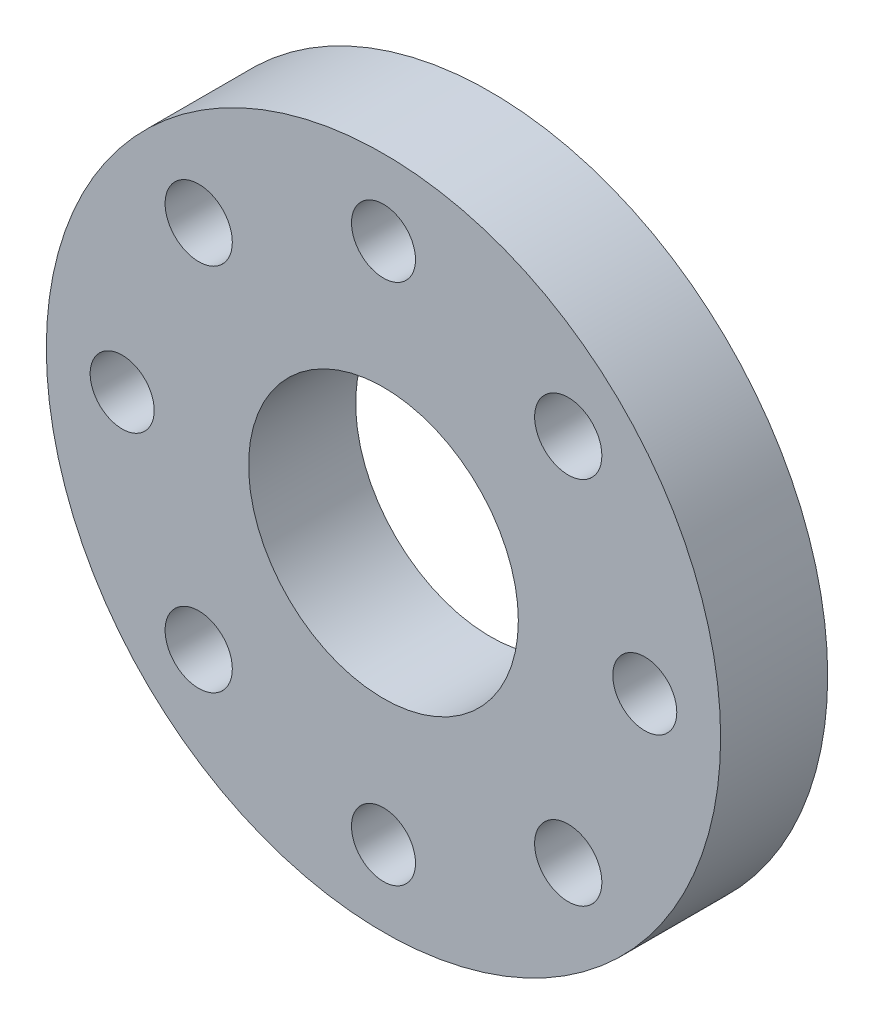
ISO-10303-21;
HEADER;
FILE_DESCRIPTION(('STEP AP214'),'2;1');
FILE_NAME('part.step','',(''),(''),'','','');
FILE_SCHEMA(('AUTOMOTIVE_DESIGN { 1 0 10303 214 1 1 1 1 }'));
ENDSEC;
DATA;
#1=APPLICATION_CONTEXT('core data for automotive mechanical design processes');
#2=APPLICATION_PROTOCOL_DEFINITION('international standard','automotive_design',2000,#1);
#3=PRODUCT_CONTEXT('',#1,'mechanical');
#4=PRODUCT('Part','Part','',(#3));
#5=PRODUCT_RELATED_PRODUCT_CATEGORY('part','',(#4));
#6=PRODUCT_DEFINITION_FORMATION('','',#4);
#7=PRODUCT_DEFINITION_CONTEXT('part definition',#1,'design');
#8=PRODUCT_DEFINITION('design','',#6,#7);
#9=PRODUCT_DEFINITION_SHAPE('','',#8);
#10=(LENGTH_UNIT() NAMED_UNIT(*) SI_UNIT(.MILLI.,.METRE.));
#11=(NAMED_UNIT(*) PLANE_ANGLE_UNIT() SI_UNIT($,.RADIAN.));
#12=(NAMED_UNIT(*) SI_UNIT($,.STERADIAN.) SOLID_ANGLE_UNIT());
#13=UNCERTAINTY_MEASURE_WITH_UNIT(LENGTH_MEASURE(1.E-05),#10,'distance_accuracy_value','');
#14=(GEOMETRIC_REPRESENTATION_CONTEXT(3) GLOBAL_UNCERTAINTY_ASSIGNED_CONTEXT((#13)) GLOBAL_UNIT_ASSIGNED_CONTEXT((#10,
#11,#12)) REPRESENTATION_CONTEXT('',''));
#15=CARTESIAN_POINT('',(0.,0.,0.));
#16=DIRECTION('',(0.,0.,1.));
#17=DIRECTION('',(1.,0.,0.));
#18=AXIS2_PLACEMENT_3D('',#15,#16,#17);
#19=CARTESIAN_POINT('',(0.,0.,6.35));
#20=DIRECTION('',(0.,0.,1.));
#21=DIRECTION('',(1.,0.,0.));
#22=AXIS2_PLACEMENT_3D('',#19,#20,#21);
#23=PLANE('',#22);
#24=CARTESIAN_POINT('',(15.5,0.,6.35));
#25=DIRECTION('',(0.,0.,1.));
#26=DIRECTION('',(1.,0.,0.));
#27=AXIS2_PLACEMENT_3D('',#24,#25,#26);
#28=CIRCLE('',#27,1.89865);
#29=CARTESIAN_POINT('',(17.39865,0.,6.35));
#30=VERTEX_POINT('',#29);
#31=EDGE_CURVE('E83',#30,#30,#28,.T.);
#32=ORIENTED_EDGE('',*,*,#31,.F.);
#33=EDGE_LOOP('',(#32));
#34=FACE_BOUND('',#33,.T.);
#35=CARTESIAN_POINT('',(0.,15.5,6.35));
#36=DIRECTION('',(0.,0.,1.));
#37=DIRECTION('',(1.,0.,0.));
#38=AXIS2_PLACEMENT_3D('',#35,#36,#37);
#39=CIRCLE('',#38,1.89865);
#40=CARTESIAN_POINT('',(1.89865,15.5,6.35));
#41=VERTEX_POINT('',#40);
#42=EDGE_CURVE('E71',#41,#41,#39,.T.);
#43=ORIENTED_EDGE('',*,*,#42,.F.);
#44=EDGE_LOOP('',(#43));
#45=FACE_BOUND('',#44,.T.);
#46=CARTESIAN_POINT('',(-15.5,0.,6.35));
#47=DIRECTION('',(0.,0.,1.));
#48=DIRECTION('',(1.,0.,0.));
#49=AXIS2_PLACEMENT_3D('',#46,#47,#48);
#50=CIRCLE('',#49,1.89865);
#51=CARTESIAN_POINT('',(-13.60135,0.,6.35));
#52=VERTEX_POINT('',#51);
#53=EDGE_CURVE('E59',#52,#52,#50,.T.);
#54=ORIENTED_EDGE('',*,*,#53,.F.);
#55=EDGE_LOOP('',(#54));
#56=FACE_BOUND('',#55,.T.);
#57=CARTESIAN_POINT('',(0.,-15.5,6.35));
#58=DIRECTION('',(0.,0.,1.));
#59=DIRECTION('',(1.,0.,0.));
#60=AXIS2_PLACEMENT_3D('',#57,#58,#59);
#61=CIRCLE('',#60,1.89865);
#62=CARTESIAN_POINT('',(1.89865,-15.5,6.35));
#63=VERTEX_POINT('',#62);
#64=EDGE_CURVE('E47',#63,#63,#61,.T.);
#65=ORIENTED_EDGE('',*,*,#64,.F.);
#66=EDGE_LOOP('',(#65));
#67=FACE_BOUND('',#66,.T.);
#68=CARTESIAN_POINT('',(0.,0.,6.35));
#69=DIRECTION('',(0.,0.,1.));
#70=DIRECTION('',(1.,0.,0.));
#71=AXIS2_PLACEMENT_3D('',#68,#69,#70);
#72=CIRCLE('',#71,20.);
#73=CARTESIAN_POINT('',(20.,0.,6.35));
#74=VERTEX_POINT('',#73);
#75=EDGE_CURVE('E10',#74,#74,#72,.T.);
#76=ORIENTED_EDGE('',*,*,#75,.T.);
#77=EDGE_LOOP('',(#76));
#78=FACE_BOUND('',#77,.T.);
#79=CARTESIAN_POINT('',(0.,0.,6.35));
#80=DIRECTION('',(0.,0.,1.));
#81=DIRECTION('',(1.,0.,0.));
#82=AXIS2_PLACEMENT_3D('',#79,#80,#81);
#83=CIRCLE('',#82,8.);
#84=CARTESIAN_POINT('',(8.,0.,6.35));
#85=VERTEX_POINT('',#84);
#86=EDGE_CURVE('E42',#85,#85,#83,.T.);
#87=ORIENTED_EDGE('',*,*,#86,.F.);
#88=EDGE_LOOP('',(#87));
#89=FACE_BOUND('',#88,.T.);
#90=CARTESIAN_POINT('',(10.9601551083915,-10.9601551083915,6.35));
#91=DIRECTION('',(0.,0.,1.));
#92=DIRECTION('',(1.,0.,0.));
#93=AXIS2_PLACEMENT_3D('',#90,#91,#92);
#94=CIRCLE('',#93,1.9939);
#95=CARTESIAN_POINT('',(12.9540551083915,-10.9601551083915,6.35));
#96=VERTEX_POINT('',#95);
#97=EDGE_CURVE('E53',#96,#96,#94,.T.);
#98=ORIENTED_EDGE('',*,*,#97,.F.);
#99=EDGE_LOOP('',(#98));
#100=FACE_BOUND('',#99,.T.);
#101=CARTESIAN_POINT('',(-10.9601551083915,-10.9601551083915,6.35));
#102=DIRECTION('',(0.,0.,1.));
#103=DIRECTION('',(1.,0.,0.));
#104=AXIS2_PLACEMENT_3D('',#101,#102,#103);
#105=CIRCLE('',#104,1.9939);
#106=CARTESIAN_POINT('',(-8.96625510839147,-10.9601551083915,6.35));
#107=VERTEX_POINT('',#106);
#108=EDGE_CURVE('E65',#107,#107,#105,.T.);
#109=ORIENTED_EDGE('',*,*,#108,.F.);
#110=EDGE_LOOP('',(#109));
#111=FACE_BOUND('',#110,.T.);
#112=CARTESIAN_POINT('',(-10.9601551083915,10.9601551083915,6.35));
#113=DIRECTION('',(0.,0.,1.));
#114=DIRECTION('',(1.,0.,0.));
#115=AXIS2_PLACEMENT_3D('',#112,#113,#114);
#116=CIRCLE('',#115,1.9939);
#117=CARTESIAN_POINT('',(-8.96625510839151,10.9601551083915,6.35));
#118=VERTEX_POINT('',#117);
#119=EDGE_CURVE('E77',#118,#118,#116,.T.);
#120=ORIENTED_EDGE('',*,*,#119,.F.);
#121=EDGE_LOOP('',(#120));
#122=FACE_BOUND('',#121,.T.);
#123=CARTESIAN_POINT('',(10.9601551083915,10.9601551083915,6.35));
#124=DIRECTION('',(0.,0.,1.));
#125=DIRECTION('',(1.,0.,0.));
#126=AXIS2_PLACEMENT_3D('',#123,#124,#125);
#127=CIRCLE('',#126,1.9939);
#128=CARTESIAN_POINT('',(12.9540551083915,10.9601551083915,6.35));
#129=VERTEX_POINT('',#128);
#130=EDGE_CURVE('E89',#129,#129,#127,.T.);
#131=ORIENTED_EDGE('',*,*,#130,.F.);
#132=EDGE_LOOP('',(#131));
#133=FACE_BOUND('',#132,.T.);
#134=ADVANCED_FACE('F31',(#34,#45,#56,#67,#78,#89,#100,#111,#122,#133),#23,.T.);
#135=CARTESIAN_POINT('',(0.,0.,0.));
#136=DIRECTION('',(0.,0.,1.));
#137=DIRECTION('',(1.,0.,0.));
#138=AXIS2_PLACEMENT_3D('',#135,#136,#137);
#139=PLANE('',#138);
#140=CARTESIAN_POINT('',(0.,0.,0.));
#141=DIRECTION('',(0.,0.,1.));
#142=DIRECTION('',(1.,0.,0.));
#143=AXIS2_PLACEMENT_3D('',#140,#141,#142);
#144=CIRCLE('',#143,20.);
#145=CARTESIAN_POINT('',(20.,0.,0.));
#146=VERTEX_POINT('',#145);
#147=EDGE_CURVE('E35',#146,#146,#144,.T.);
#148=ORIENTED_EDGE('',*,*,#147,.F.);
#149=EDGE_LOOP('',(#148));
#150=FACE_BOUND('',#149,.T.);
#151=CARTESIAN_POINT('',(0.,0.,0.));
#152=DIRECTION('',(0.,0.,1.));
#153=DIRECTION('',(1.,0.,0.));
#154=AXIS2_PLACEMENT_3D('',#151,#152,#153);
#155=CIRCLE('',#154,8.);
#156=CARTESIAN_POINT('',(8.,0.,0.));
#157=VERTEX_POINT('',#156);
#158=EDGE_CURVE('E44',#157,#157,#155,.T.);
#159=ORIENTED_EDGE('',*,*,#158,.T.);
#160=EDGE_LOOP('',(#159));
#161=FACE_BOUND('',#160,.T.);
#162=CARTESIAN_POINT('',(0.,-15.5,0.));
#163=DIRECTION('',(0.,0.,1.));
#164=DIRECTION('',(1.,0.,0.));
#165=AXIS2_PLACEMENT_3D('',#162,#163,#164);
#166=CIRCLE('',#165,1.89865);
#167=CARTESIAN_POINT('',(1.89865,-15.5,0.));
#168=VERTEX_POINT('',#167);
#169=EDGE_CURVE('E50',#168,#168,#166,.T.);
#170=ORIENTED_EDGE('',*,*,#169,.T.);
#171=EDGE_LOOP('',(#170));
#172=FACE_BOUND('',#171,.T.);
#173=CARTESIAN_POINT('',(10.9601551083915,-10.9601551083915,0.));
#174=DIRECTION('',(0.,0.,1.));
#175=DIRECTION('',(1.,0.,0.));
#176=AXIS2_PLACEMENT_3D('',#173,#174,#175);
#177=CIRCLE('',#176,1.9939);
#178=CARTESIAN_POINT('',(12.9540551083915,-10.9601551083915,0.));
#179=VERTEX_POINT('',#178);
#180=EDGE_CURVE('E56',#179,#179,#177,.T.);
#181=ORIENTED_EDGE('',*,*,#180,.T.);
#182=EDGE_LOOP('',(#181));
#183=FACE_BOUND('',#182,.T.);
#184=CARTESIAN_POINT('',(-15.5,0.,0.));
#185=DIRECTION('',(0.,0.,1.));
#186=DIRECTION('',(1.,0.,0.));
#187=AXIS2_PLACEMENT_3D('',#184,#185,#186);
#188=CIRCLE('',#187,1.89865);
#189=CARTESIAN_POINT('',(-13.60135,0.,0.));
#190=VERTEX_POINT('',#189);
#191=EDGE_CURVE('E62',#190,#190,#188,.T.);
#192=ORIENTED_EDGE('',*,*,#191,.T.);
#193=EDGE_LOOP('',(#192));
#194=FACE_BOUND('',#193,.T.);
#195=CARTESIAN_POINT('',(-10.9601551083915,-10.9601551083915,0.));
#196=DIRECTION('',(0.,0.,1.));
#197=DIRECTION('',(1.,0.,0.));
#198=AXIS2_PLACEMENT_3D('',#195,#196,#197);
#199=CIRCLE('',#198,1.9939);
#200=CARTESIAN_POINT('',(-8.96625510839147,-10.9601551083915,0.));
#201=VERTEX_POINT('',#200);
#202=EDGE_CURVE('E68',#201,#201,#199,.T.);
#203=ORIENTED_EDGE('',*,*,#202,.T.);
#204=EDGE_LOOP('',(#203));
#205=FACE_BOUND('',#204,.T.);
#206=CARTESIAN_POINT('',(0.,15.5,0.));
#207=DIRECTION('',(0.,0.,1.));
#208=DIRECTION('',(1.,0.,0.));
#209=AXIS2_PLACEMENT_3D('',#206,#207,#208);
#210=CIRCLE('',#209,1.89865);
#211=CARTESIAN_POINT('',(1.89865,15.5,0.));
#212=VERTEX_POINT('',#211);
#213=EDGE_CURVE('E74',#212,#212,#210,.T.);
#214=ORIENTED_EDGE('',*,*,#213,.T.);
#215=EDGE_LOOP('',(#214));
#216=FACE_BOUND('',#215,.T.);
#217=CARTESIAN_POINT('',(-10.9601551083915,10.9601551083915,0.));
#218=DIRECTION('',(0.,0.,1.));
#219=DIRECTION('',(1.,0.,0.));
#220=AXIS2_PLACEMENT_3D('',#217,#218,#219);
#221=CIRCLE('',#220,1.9939);
#222=CARTESIAN_POINT('',(-8.96625510839151,10.9601551083915,0.));
#223=VERTEX_POINT('',#222);
#224=EDGE_CURVE('E80',#223,#223,#221,.T.);
#225=ORIENTED_EDGE('',*,*,#224,.T.);
#226=EDGE_LOOP('',(#225));
#227=FACE_BOUND('',#226,.T.);
#228=CARTESIAN_POINT('',(15.5,0.,0.));
#229=DIRECTION('',(0.,0.,1.));
#230=DIRECTION('',(1.,0.,0.));
#231=AXIS2_PLACEMENT_3D('',#228,#229,#230);
#232=CIRCLE('',#231,1.89865);
#233=CARTESIAN_POINT('',(17.39865,0.,0.));
#234=VERTEX_POINT('',#233);
#235=EDGE_CURVE('E86',#234,#234,#232,.T.);
#236=ORIENTED_EDGE('',*,*,#235,.T.);
#237=EDGE_LOOP('',(#236));
#238=FACE_BOUND('',#237,.T.);
#239=CARTESIAN_POINT('',(10.9601551083915,10.9601551083915,0.));
#240=DIRECTION('',(0.,0.,1.));
#241=DIRECTION('',(1.,0.,0.));
#242=AXIS2_PLACEMENT_3D('',#239,#240,#241);
#243=CIRCLE('',#242,1.9939);
#244=CARTESIAN_POINT('',(12.9540551083915,10.9601551083915,0.));
#245=VERTEX_POINT('',#244);
#246=EDGE_CURVE('E92',#245,#245,#243,.T.);
#247=ORIENTED_EDGE('',*,*,#246,.T.);
#248=EDGE_LOOP('',(#247));
#249=FACE_BOUND('',#248,.T.);
#250=ADVANCED_FACE('F102',(#150,#161,#172,#183,#194,#205,#216,#227,#238,#249),#139,.F.);
#251=CARTESIAN_POINT('',(0.,0.,6.35));
#252=DIRECTION('',(0.,0.,-1.));
#253=DIRECTION('',(-1.,0.,0.));
#254=AXIS2_PLACEMENT_3D('',#251,#252,#253);
#255=CYLINDRICAL_SURFACE('',#254,20.);
#256=ORIENTED_EDGE('',*,*,#75,.F.);
#257=EDGE_LOOP('',(#256));
#258=FACE_BOUND('',#257,.T.);
#259=ORIENTED_EDGE('',*,*,#147,.T.);
#260=EDGE_LOOP('',(#259));
#261=FACE_BOUND('',#260,.T.);
#262=ADVANCED_FACE('F33',(#258,#261),#255,.T.);
#263=CARTESIAN_POINT('',(0.,0.,6.35));
#264=DIRECTION('',(0.,0.,-1.));
#265=DIRECTION('',(-1.,0.,0.));
#266=AXIS2_PLACEMENT_3D('',#263,#264,#265);
#267=CYLINDRICAL_SURFACE('',#266,8.);
#268=ORIENTED_EDGE('',*,*,#86,.T.);
#269=EDGE_LOOP('',(#268));
#270=FACE_BOUND('',#269,.T.);
#271=ORIENTED_EDGE('',*,*,#158,.F.);
#272=EDGE_LOOP('',(#271));
#273=FACE_BOUND('',#272,.T.);
#274=ADVANCED_FACE('F112',(#270,#273),#267,.F.);
#275=CARTESIAN_POINT('',(0.,-15.5,6.35));
#276=DIRECTION('',(0.,0.,-1.));
#277=DIRECTION('',(-1.,0.,0.));
#278=AXIS2_PLACEMENT_3D('',#275,#276,#277);
#279=CYLINDRICAL_SURFACE('',#278,1.89865);
#280=ORIENTED_EDGE('',*,*,#64,.T.);
#281=EDGE_LOOP('',(#280));
#282=FACE_BOUND('',#281,.T.);
#283=ORIENTED_EDGE('',*,*,#169,.F.);
#284=EDGE_LOOP('',(#283));
#285=FACE_BOUND('',#284,.T.);
#286=ADVANCED_FACE('F115',(#282,#285),#279,.F.);
#287=CARTESIAN_POINT('',(10.9601551083915,-10.9601551083915,6.35));
#288=DIRECTION('',(0.,0.,-1.));
#289=DIRECTION('',(-1.,0.,0.));
#290=AXIS2_PLACEMENT_3D('',#287,#288,#289);
#291=CYLINDRICAL_SURFACE('',#290,1.9939);
#292=ORIENTED_EDGE('',*,*,#97,.T.);
#293=EDGE_LOOP('',(#292));
#294=FACE_BOUND('',#293,.T.);
#295=ORIENTED_EDGE('',*,*,#180,.F.);
#296=EDGE_LOOP('',(#295));
#297=FACE_BOUND('',#296,.T.);
#298=ADVANCED_FACE('F119',(#294,#297),#291,.F.);
#299=CARTESIAN_POINT('',(-15.5,0.,6.35));
#300=DIRECTION('',(0.,0.,-1.));
#301=DIRECTION('',(-1.,0.,0.));
#302=AXIS2_PLACEMENT_3D('',#299,#300,#301);
#303=CYLINDRICAL_SURFACE('',#302,1.89865);
#304=ORIENTED_EDGE('',*,*,#53,.T.);
#305=EDGE_LOOP('',(#304));
#306=FACE_BOUND('',#305,.T.);
#307=ORIENTED_EDGE('',*,*,#191,.F.);
#308=EDGE_LOOP('',(#307));
#309=FACE_BOUND('',#308,.T.);
#310=ADVANCED_FACE('F123',(#306,#309),#303,.F.);
#311=CARTESIAN_POINT('',(-10.9601551083915,-10.9601551083915,6.35));
#312=DIRECTION('',(0.,0.,-1.));
#313=DIRECTION('',(-1.,0.,0.));
#314=AXIS2_PLACEMENT_3D('',#311,#312,#313);
#315=CYLINDRICAL_SURFACE('',#314,1.9939);
#316=ORIENTED_EDGE('',*,*,#108,.T.);
#317=EDGE_LOOP('',(#316));
#318=FACE_BOUND('',#317,.T.);
#319=ORIENTED_EDGE('',*,*,#202,.F.);
#320=EDGE_LOOP('',(#319));
#321=FACE_BOUND('',#320,.T.);
#322=ADVANCED_FACE('F127',(#318,#321),#315,.F.);
#323=CARTESIAN_POINT('',(0.,15.5,6.35));
#324=DIRECTION('',(0.,0.,-1.));
#325=DIRECTION('',(-1.,0.,0.));
#326=AXIS2_PLACEMENT_3D('',#323,#324,#325);
#327=CYLINDRICAL_SURFACE('',#326,1.89865);
#328=ORIENTED_EDGE('',*,*,#42,.T.);
#329=EDGE_LOOP('',(#328));
#330=FACE_BOUND('',#329,.T.);
#331=ORIENTED_EDGE('',*,*,#213,.F.);
#332=EDGE_LOOP('',(#331));
#333=FACE_BOUND('',#332,.T.);
#334=ADVANCED_FACE('F131',(#330,#333),#327,.F.);
#335=CARTESIAN_POINT('',(-10.9601551083915,10.9601551083915,6.35));
#336=DIRECTION('',(0.,0.,-1.));
#337=DIRECTION('',(-1.,0.,0.));
#338=AXIS2_PLACEMENT_3D('',#335,#336,#337);
#339=CYLINDRICAL_SURFACE('',#338,1.9939);
#340=ORIENTED_EDGE('',*,*,#119,.T.);
#341=EDGE_LOOP('',(#340));
#342=FACE_BOUND('',#341,.T.);
#343=ORIENTED_EDGE('',*,*,#224,.F.);
#344=EDGE_LOOP('',(#343));
#345=FACE_BOUND('',#344,.T.);
#346=ADVANCED_FACE('F135',(#342,#345),#339,.F.);
#347=CARTESIAN_POINT('',(15.5,0.,6.35));
#348=DIRECTION('',(0.,0.,-1.));
#349=DIRECTION('',(-1.,0.,0.));
#350=AXIS2_PLACEMENT_3D('',#347,#348,#349);
#351=CYLINDRICAL_SURFACE('',#350,1.89865);
#352=ORIENTED_EDGE('',*,*,#31,.T.);
#353=EDGE_LOOP('',(#352));
#354=FACE_BOUND('',#353,.T.);
#355=ORIENTED_EDGE('',*,*,#235,.F.);
#356=EDGE_LOOP('',(#355));
#357=FACE_BOUND('',#356,.T.);
#358=ADVANCED_FACE('F139',(#354,#357),#351,.F.);
#359=CARTESIAN_POINT('',(10.9601551083915,10.9601551083915,6.35));
#360=DIRECTION('',(0.,0.,-1.));
#361=DIRECTION('',(-1.,0.,0.));
#362=AXIS2_PLACEMENT_3D('',#359,#360,#361);
#363=CYLINDRICAL_SURFACE('',#362,1.9939);
#364=ORIENTED_EDGE('',*,*,#130,.T.);
#365=EDGE_LOOP('',(#364));
#366=FACE_BOUND('',#365,.T.);
#367=ORIENTED_EDGE('',*,*,#246,.F.);
#368=EDGE_LOOP('',(#367));
#369=FACE_BOUND('',#368,.T.);
#370=ADVANCED_FACE('F98',(#366,#369),#363,.F.);
#371=CLOSED_SHELL('',(#134,#250,#262,#274,#286,#298,#310,#322,#334,#346,#358,#370));
#372=MANIFOLD_SOLID_BREP('B2',#371);
#373=ADVANCED_BREP_SHAPE_REPRESENTATION('',(#18,#372),#14);
#374=SHAPE_DEFINITION_REPRESENTATION(#9,#373);
ENDSEC;
END-ISO-10303-21;
